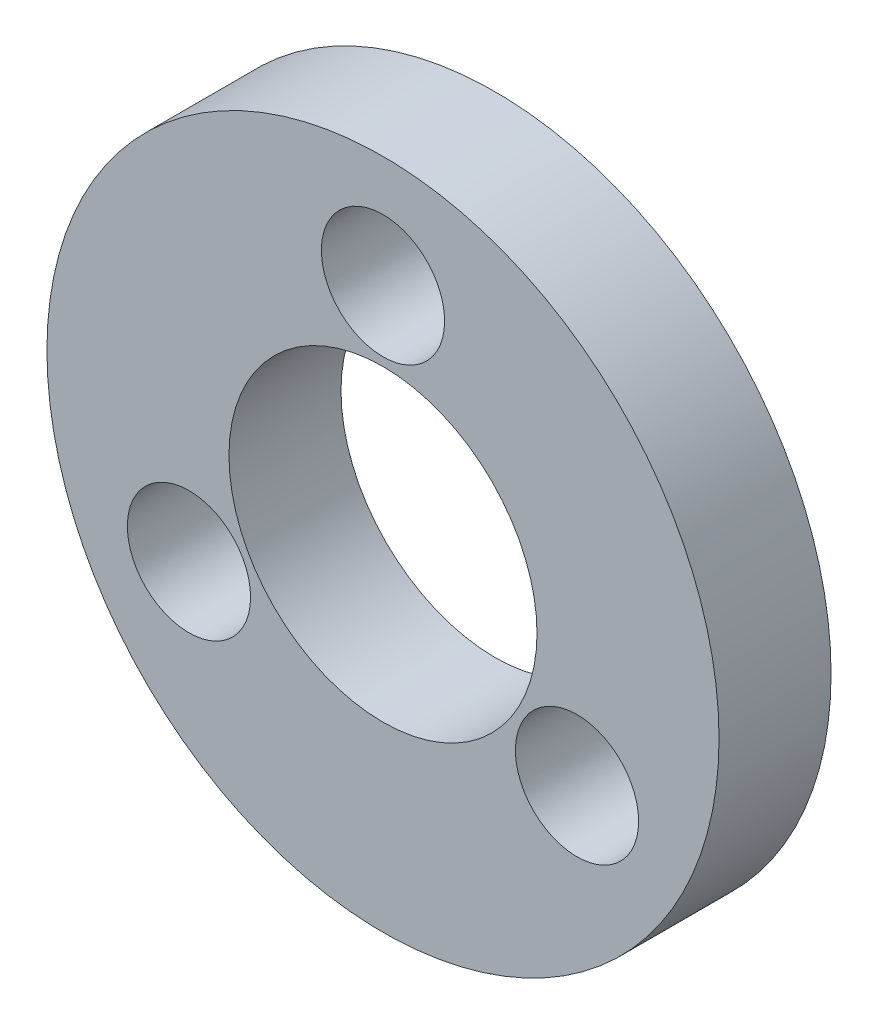
ISO-10303-21;
HEADER;
FILE_DESCRIPTION(('STEP AP214'),'2;1');
FILE_NAME('part.step','',(''),(''),'','','');
FILE_SCHEMA(('AUTOMOTIVE_DESIGN { 1 0 10303 214 1 1 1 1 }'));
ENDSEC;
DATA;
#1=APPLICATION_CONTEXT('core data for automotive mechanical design processes');
#2=APPLICATION_PROTOCOL_DEFINITION('international standard','automotive_design',2000,#1);
#3=PRODUCT_CONTEXT('',#1,'mechanical');
#4=PRODUCT('Part','Part','',(#3));
#5=PRODUCT_RELATED_PRODUCT_CATEGORY('part','',(#4));
#6=PRODUCT_DEFINITION_FORMATION('','',#4);
#7=PRODUCT_DEFINITION_CONTEXT('part definition',#1,'design');
#8=PRODUCT_DEFINITION('design','',#6,#7);
#9=PRODUCT_DEFINITION_SHAPE('','',#8);
#10=(LENGTH_UNIT() NAMED_UNIT(*) SI_UNIT(.MILLI.,.METRE.));
#11=(NAMED_UNIT(*) PLANE_ANGLE_UNIT() SI_UNIT($,.RADIAN.));
#12=(NAMED_UNIT(*) SI_UNIT($,.STERADIAN.) SOLID_ANGLE_UNIT());
#13=UNCERTAINTY_MEASURE_WITH_UNIT(LENGTH_MEASURE(1.E-05),#10,'distance_accuracy_value','');
#14=(GEOMETRIC_REPRESENTATION_CONTEXT(3) GLOBAL_UNCERTAINTY_ASSIGNED_CONTEXT((#13)) GLOBAL_UNIT_ASSIGNED_CONTEXT((#10,
#11,#12)) REPRESENTATION_CONTEXT('',''));
#15=CARTESIAN_POINT('',(0.,0.,0.));
#16=DIRECTION('',(0.,0.,1.));
#17=DIRECTION('',(1.,0.,0.));
#18=AXIS2_PLACEMENT_3D('',#15,#16,#17);
#19=CARTESIAN_POINT('',(-27.5,59.9979166304964,-2.));
#20=DIRECTION('',(0.,0.,1.));
#21=DIRECTION('',(1.,0.,0.));
#22=AXIS2_PLACEMENT_3D('',#19,#20,#21);
#23=CYLINDRICAL_SURFACE('',#22,6.00000000000001);
#24=CARTESIAN_POINT('',(-27.5,59.9979166304964,-2.));
#25=DIRECTION('',(0.,0.,1.));
#26=DIRECTION('',(1.,0.,0.));
#27=AXIS2_PLACEMENT_3D('',#24,#25,#26);
#28=CIRCLE('',#27,6.00000000000001);
#29=CARTESIAN_POINT('',(-21.5,59.9979166304964,-2.));
#30=VERTEX_POINT('',#29);
#31=EDGE_CURVE('E10',#30,#30,#28,.T.);
#32=ORIENTED_EDGE('',*,*,#31,.T.);
#33=EDGE_LOOP('',(#32));
#34=FACE_BOUND('',#33,.T.);
#35=CARTESIAN_POINT('',(-27.5,59.9979166304964,0.));
#36=DIRECTION('',(0.,0.,1.));
#37=DIRECTION('',(1.,0.,0.));
#38=AXIS2_PLACEMENT_3D('',#35,#36,#37);
#39=CIRCLE('',#38,6.00000000000001);
#40=CARTESIAN_POINT('',(-21.5,59.9979166304964,0.));
#41=VERTEX_POINT('',#40);
#42=EDGE_CURVE('E36',#41,#41,#39,.T.);
#43=ORIENTED_EDGE('',*,*,#42,.F.);
#44=EDGE_LOOP('',(#43));
#45=FACE_BOUND('',#44,.T.);
#46=ADVANCED_FACE('F33',(#34,#45),#23,.T.);
#47=CARTESIAN_POINT('',(-27.5,59.9979166304964,-2.));
#48=DIRECTION('',(0.,0.,1.));
#49=DIRECTION('',(1.,0.,0.));
#50=AXIS2_PLACEMENT_3D('',#47,#48,#49);
#51=PLANE('',#50);
#52=CARTESIAN_POINT('',(-27.5,63.9979166304964,-2.));
#53=DIRECTION('',(0.,0.,1.));
#54=DIRECTION('',(1.,0.,0.));
#55=AXIS2_PLACEMENT_3D('',#52,#53,#54);
#56=CIRCLE('',#55,1.1);
#57=CARTESIAN_POINT('',(-26.4,63.9979166304964,-2.));
#58=VERTEX_POINT('',#57);
#59=EDGE_CURVE('E62',#58,#58,#56,.T.);
#60=ORIENTED_EDGE('',*,*,#59,.T.);
#61=EDGE_LOOP('',(#60));
#62=FACE_BOUND('',#61,.T.);
#63=CARTESIAN_POINT('',(-24.0358983848622,57.9979166304964,-2.));
#64=DIRECTION('',(0.,0.,1.));
#65=DIRECTION('',(1.,0.,0.));
#66=AXIS2_PLACEMENT_3D('',#63,#64,#65);
#67=CIRCLE('',#66,1.1);
#68=CARTESIAN_POINT('',(-22.9358983848622,57.9979166304964,-2.));
#69=VERTEX_POINT('',#68);
#70=EDGE_CURVE('E56',#69,#69,#67,.T.);
#71=ORIENTED_EDGE('',*,*,#70,.T.);
#72=EDGE_LOOP('',(#71));
#73=FACE_BOUND('',#72,.T.);
#74=CARTESIAN_POINT('',(-30.9641016151378,57.9979166304964,-2.));
#75=DIRECTION('',(0.,0.,1.));
#76=DIRECTION('',(1.,0.,0.));
#77=AXIS2_PLACEMENT_3D('',#74,#75,#76);
#78=CIRCLE('',#77,1.1);
#79=CARTESIAN_POINT('',(-29.8641016151378,57.9979166304964,-2.));
#80=VERTEX_POINT('',#79);
#81=EDGE_CURVE('E48',#80,#80,#78,.T.);
#82=ORIENTED_EDGE('',*,*,#81,.T.);
#83=EDGE_LOOP('',(#82));
#84=FACE_BOUND('',#83,.T.);
#85=CARTESIAN_POINT('',(-27.5,59.9979166304964,-2.));
#86=DIRECTION('',(0.,0.,1.));
#87=DIRECTION('',(1.,0.,0.));
#88=AXIS2_PLACEMENT_3D('',#85,#86,#87);
#89=CIRCLE('',#88,2.75);
#90=CARTESIAN_POINT('',(-24.75,59.9979166304964,-2.));
#91=VERTEX_POINT('',#90);
#92=EDGE_CURVE('E43',#91,#91,#89,.T.);
#93=ORIENTED_EDGE('',*,*,#92,.T.);
#94=EDGE_LOOP('',(#93));
#95=FACE_BOUND('',#94,.T.);
#96=ORIENTED_EDGE('',*,*,#31,.F.);
#97=EDGE_LOOP('',(#96));
#98=FACE_BOUND('',#97,.T.);
#99=ADVANCED_FACE('F75',(#62,#73,#84,#95,#98),#51,.F.);
#100=CARTESIAN_POINT('',(-27.5,59.9979166304964,0.));
#101=DIRECTION('',(0.,0.,1.));
#102=DIRECTION('',(1.,0.,0.));
#103=AXIS2_PLACEMENT_3D('',#100,#101,#102);
#104=PLANE('',#103);
#105=CARTESIAN_POINT('',(-27.5,63.9979166304964,0.));
#106=DIRECTION('',(0.,0.,1.));
#107=DIRECTION('',(1.,0.,0.));
#108=AXIS2_PLACEMENT_3D('',#105,#106,#107);
#109=CIRCLE('',#108,1.09999999999999);
#110=CARTESIAN_POINT('',(-26.4,63.9979166304964,0.));
#111=VERTEX_POINT('',#110);
#112=EDGE_CURVE('E65',#111,#111,#109,.T.);
#113=ORIENTED_EDGE('',*,*,#112,.F.);
#114=EDGE_LOOP('',(#113));
#115=FACE_BOUND('',#114,.T.);
#116=CARTESIAN_POINT('',(-24.0358983848622,57.9979166304964,0.));
#117=DIRECTION('',(0.,0.,1.));
#118=DIRECTION('',(1.,0.,0.));
#119=AXIS2_PLACEMENT_3D('',#116,#117,#118);
#120=CIRCLE('',#119,1.09999999999999);
#121=CARTESIAN_POINT('',(-22.9358983848622,57.9979166304964,0.));
#122=VERTEX_POINT('',#121);
#123=EDGE_CURVE('E59',#122,#122,#120,.T.);
#124=ORIENTED_EDGE('',*,*,#123,.F.);
#125=EDGE_LOOP('',(#124));
#126=FACE_BOUND('',#125,.T.);
#127=CARTESIAN_POINT('',(-30.9641016151378,57.9979166304964,0.));
#128=DIRECTION('',(0.,0.,1.));
#129=DIRECTION('',(1.,0.,0.));
#130=AXIS2_PLACEMENT_3D('',#127,#128,#129);
#131=CIRCLE('',#130,1.09999999999999);
#132=CARTESIAN_POINT('',(-29.8641016151378,57.9979166304964,0.));
#133=VERTEX_POINT('',#132);
#134=EDGE_CURVE('E53',#133,#133,#131,.T.);
#135=ORIENTED_EDGE('',*,*,#134,.F.);
#136=EDGE_LOOP('',(#135));
#137=FACE_BOUND('',#136,.T.);
#138=CARTESIAN_POINT('',(-27.5,59.9979166304964,0.));
#139=DIRECTION('',(0.,0.,1.));
#140=DIRECTION('',(1.,0.,0.));
#141=AXIS2_PLACEMENT_3D('',#138,#139,#140);
#142=CIRCLE('',#141,2.75);
#143=CARTESIAN_POINT('',(-24.75,59.9979166304964,0.));
#144=VERTEX_POINT('',#143);
#145=EDGE_CURVE('E45',#144,#144,#142,.T.);
#146=ORIENTED_EDGE('',*,*,#145,.F.);
#147=EDGE_LOOP('',(#146));
#148=FACE_BOUND('',#147,.T.);
#149=ORIENTED_EDGE('',*,*,#42,.T.);
#150=EDGE_LOOP('',(#149));
#151=FACE_BOUND('',#150,.T.);
#152=ADVANCED_FACE('F71',(#115,#126,#137,#148,#151),#104,.T.);
#153=CARTESIAN_POINT('',(-27.5,59.9979166304964,-2.));
#154=DIRECTION('',(0.,0.,1.));
#155=DIRECTION('',(1.,0.,0.));
#156=AXIS2_PLACEMENT_3D('',#153,#154,#155);
#157=CYLINDRICAL_SURFACE('',#156,2.75);
#158=ORIENTED_EDGE('',*,*,#92,.F.);
#159=EDGE_LOOP('',(#158));
#160=FACE_BOUND('',#159,.T.);
#161=ORIENTED_EDGE('',*,*,#145,.T.);
#162=EDGE_LOOP('',(#161));
#163=FACE_BOUND('',#162,.T.);
#164=ADVANCED_FACE('F74',(#160,#163),#157,.F.);
#165=CARTESIAN_POINT('',(-30.9641016151378,57.9979166304964,0.));
#166=DIRECTION('',(0.,0.,1.));
#167=DIRECTION('',(1.,0.,0.));
#168=AXIS2_PLACEMENT_3D('',#165,#166,#167);
#169=CYLINDRICAL_SURFACE('',#168,1.09999999999999);
#170=ORIENTED_EDGE('',*,*,#81,.F.);
#171=EDGE_LOOP('',(#170));
#172=FACE_BOUND('',#171,.T.);
#173=ORIENTED_EDGE('',*,*,#134,.T.);
#174=EDGE_LOOP('',(#173));
#175=FACE_BOUND('',#174,.T.);
#176=ADVANCED_FACE('F96',(#172,#175),#169,.F.);
#177=CARTESIAN_POINT('',(-24.0358983848622,57.9979166304964,0.));
#178=DIRECTION('',(0.,0.,1.));
#179=DIRECTION('',(1.,0.,0.));
#180=AXIS2_PLACEMENT_3D('',#177,#178,#179);
#181=CYLINDRICAL_SURFACE('',#180,1.09999999999999);
#182=ORIENTED_EDGE('',*,*,#70,.F.);
#183=EDGE_LOOP('',(#182));
#184=FACE_BOUND('',#183,.T.);
#185=ORIENTED_EDGE('',*,*,#123,.T.);
#186=EDGE_LOOP('',(#185));
#187=FACE_BOUND('',#186,.T.);
#188=ADVANCED_FACE('F100',(#184,#187),#181,.F.);
#189=CARTESIAN_POINT('',(-27.5,63.9979166304964,0.));
#190=DIRECTION('',(0.,0.,1.));
#191=DIRECTION('',(1.,0.,0.));
#192=AXIS2_PLACEMENT_3D('',#189,#190,#191);
#193=CYLINDRICAL_SURFACE('',#192,1.09999999999999);
#194=ORIENTED_EDGE('',*,*,#59,.F.);
#195=EDGE_LOOP('',(#194));
#196=FACE_BOUND('',#195,.T.);
#197=ORIENTED_EDGE('',*,*,#112,.T.);
#198=EDGE_LOOP('',(#197));
#199=FACE_BOUND('',#198,.T.);
#200=ADVANCED_FACE('F69',(#196,#199),#193,.F.);
#201=CLOSED_SHELL('',(#46,#99,#152,#164,#176,#188,#200));
#202=MANIFOLD_SOLID_BREP('B2',#201);
#203=ADVANCED_BREP_SHAPE_REPRESENTATION('',(#18,#202),#14);
#204=SHAPE_DEFINITION_REPRESENTATION(#9,#203);
ENDSEC;
END-ISO-10303-21;
